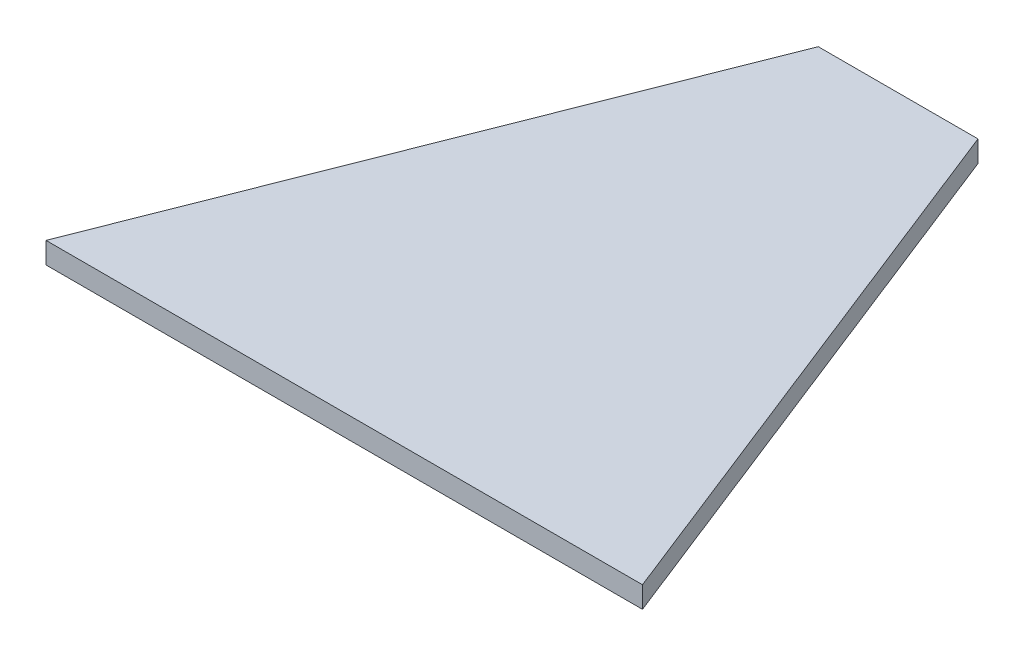
ISO-10303-21;
HEADER;
FILE_DESCRIPTION(('STEP AP214'),'2;1');
FILE_NAME('part.step','',(''),(''),'','','');
FILE_SCHEMA(('AUTOMOTIVE_DESIGN { 1 0 10303 214 1 1 1 1 }'));
ENDSEC;
DATA;
#1=APPLICATION_CONTEXT('core data for automotive mechanical design processes');
#2=APPLICATION_PROTOCOL_DEFINITION('international standard','automotive_design',2000,#1);
#3=PRODUCT_CONTEXT('',#1,'mechanical');
#4=PRODUCT('Part','Part','',(#3));
#5=PRODUCT_RELATED_PRODUCT_CATEGORY('part','',(#4));
#6=PRODUCT_DEFINITION_FORMATION('','',#4);
#7=PRODUCT_DEFINITION_CONTEXT('part definition',#1,'design');
#8=PRODUCT_DEFINITION('design','',#6,#7);
#9=PRODUCT_DEFINITION_SHAPE('','',#8);
#10=(LENGTH_UNIT() NAMED_UNIT(*) SI_UNIT(.MILLI.,.METRE.));
#11=(NAMED_UNIT(*) PLANE_ANGLE_UNIT() SI_UNIT($,.RADIAN.));
#12=(NAMED_UNIT(*) SI_UNIT($,.STERADIAN.) SOLID_ANGLE_UNIT());
#13=UNCERTAINTY_MEASURE_WITH_UNIT(LENGTH_MEASURE(1.E-05),#10,'distance_accuracy_value','');
#14=(GEOMETRIC_REPRESENTATION_CONTEXT(3) GLOBAL_UNCERTAINTY_ASSIGNED_CONTEXT((#13)) GLOBAL_UNIT_ASSIGNED_CONTEXT((#10,
#11,#12)) REPRESENTATION_CONTEXT('',''));
#15=CARTESIAN_POINT('',(0.,0.,0.));
#16=DIRECTION('',(0.,0.,1.));
#17=DIRECTION('',(1.,0.,0.));
#18=AXIS2_PLACEMENT_3D('',#15,#16,#17);
#19=CARTESIAN_POINT('',(-14.9999999999997,3.99999999999999,-104.));
#20=DIRECTION('',(0.930315923249783,0.,0.36675916205039));
#21=DIRECTION('',(0.36675916205039,0.,-0.930315923249782));
#22=AXIS2_PLACEMENT_3D('',#19,#20,#21);
#23=PLANE('',#22);
#24=DIRECTION('',(-0.36675916205039,0.,0.930315923249782));
#25=VECTOR('',#24,1.);
#26=CARTESIAN_POINT('',(-14.9999999999997,0.,-104.));
#27=LINE('',#26,#25);
#28=CARTESIAN_POINT('',(-14.9999999999997,0.,-104.));
#29=VERTEX_POINT('',#28);
#30=CARTESIAN_POINT('',(-55.9999999999995,0.,-4.44089209850063E-13));
#31=VERTEX_POINT('',#30);
#32=EDGE_CURVE('E97',#29,#31,#27,.T.);
#33=ORIENTED_EDGE('',*,*,#32,.T.);
#34=DIRECTION('',(0.,-1.,0.));
#35=VECTOR('',#34,1.);
#36=CARTESIAN_POINT('',(-55.9999999999995,3.99999999999999,-4.44089209850063E-13));
#37=LINE('',#36,#35);
#38=CARTESIAN_POINT('',(-55.9999999999995,3.99999999999999,-4.44089209850063E-13));
#39=VERTEX_POINT('',#38);
#40=EDGE_CURVE('E11',#39,#31,#37,.T.);
#41=ORIENTED_EDGE('',*,*,#40,.F.);
#42=DIRECTION('',(-0.36675916205039,0.,0.930315923249782));
#43=VECTOR('',#42,1.);
#44=CARTESIAN_POINT('',(-14.9999999999997,3.99999999999999,-104.));
#45=LINE('',#44,#43);
#46=CARTESIAN_POINT('',(-14.9999999999997,3.99999999999999,-104.));
#47=VERTEX_POINT('',#46);
#48=EDGE_CURVE('E85',#47,#39,#45,.T.);
#49=ORIENTED_EDGE('',*,*,#48,.F.);
#50=DIRECTION('',(0.,-1.,0.));
#51=VECTOR('',#50,1.);
#52=CARTESIAN_POINT('',(-14.9999999999997,3.99999999999999,-104.));
#53=LINE('',#52,#51);
#54=EDGE_CURVE('E93',#47,#29,#53,.T.);
#55=ORIENTED_EDGE('',*,*,#54,.T.);
#56=EDGE_LOOP('',(#33,#41,#49,#55));
#57=FACE_BOUND('',#56,.T.);
#58=ADVANCED_FACE('F34',(#57),#23,.F.);
#59=CARTESIAN_POINT('',(-55.9999999999995,3.99999999999999,-4.44089209850063E-13));
#60=DIRECTION('',(0.,0.,-0.999999999999999));
#61=DIRECTION('',(-1.,0.,0.));
#62=AXIS2_PLACEMENT_3D('',#59,#60,#61);
#63=PLANE('',#62);
#64=DIRECTION('',(1.,0.,0.));
#65=VECTOR('',#64,1.);
#66=CARTESIAN_POINT('',(-55.9999999999995,0.,-4.44089209850063E-13));
#67=LINE('',#66,#65);
#68=CARTESIAN_POINT('',(55.9999999999987,0.,0.));
#69=VERTEX_POINT('',#68);
#70=EDGE_CURVE('E89',#31,#69,#67,.T.);
#71=ORIENTED_EDGE('',*,*,#70,.T.);
#72=DIRECTION('',(0.,-1.,0.));
#73=VECTOR('',#72,1.);
#74=CARTESIAN_POINT('',(55.9999999999987,3.99999999999999,0.));
#75=LINE('',#74,#73);
#76=CARTESIAN_POINT('',(55.9999999999987,3.99999999999999,0.));
#77=VERTEX_POINT('',#76);
#78=EDGE_CURVE('E42',#77,#69,#75,.T.);
#79=ORIENTED_EDGE('',*,*,#78,.F.);
#80=DIRECTION('',(1.,0.,0.));
#81=VECTOR('',#80,1.);
#82=CARTESIAN_POINT('',(-55.9999999999995,3.99999999999999,-4.44089209850063E-13));
#83=LINE('',#82,#81);
#84=EDGE_CURVE('E80',#39,#77,#83,.T.);
#85=ORIENTED_EDGE('',*,*,#84,.F.);
#86=ORIENTED_EDGE('',*,*,#40,.T.);
#87=EDGE_LOOP('',(#71,#79,#85,#86));
#88=FACE_BOUND('',#87,.T.);
#89=ADVANCED_FACE('F88',(#88),#63,.F.);
#90=CARTESIAN_POINT('',(55.9999999999987,3.99999999999999,0.));
#91=DIRECTION('',(-0.930315923249785,0.,0.366759162050385));
#92=DIRECTION('',(0.366759162050385,0.,0.930315923249784));
#93=AXIS2_PLACEMENT_3D('',#90,#91,#92);
#94=PLANE('',#93);
#95=DIRECTION('',(-0.366759162050385,0.,-0.930315923249784));
#96=VECTOR('',#95,1.);
#97=CARTESIAN_POINT('',(55.9999999999987,0.,0.));
#98=LINE('',#97,#96);
#99=CARTESIAN_POINT('',(15.0000000000003,0.,-104.));
#100=VERTEX_POINT('',#99);
#101=EDGE_CURVE('E67',#69,#100,#98,.T.);
#102=ORIENTED_EDGE('',*,*,#101,.T.);
#103=DIRECTION('',(0.,-1.,0.));
#104=VECTOR('',#103,1.);
#105=CARTESIAN_POINT('',(15.0000000000003,4.00000000000002,-104.));
#106=LINE('',#105,#104);
#107=CARTESIAN_POINT('',(15.0000000000003,4.00000000000002,-104.));
#108=VERTEX_POINT('',#107);
#109=EDGE_CURVE('E90',#108,#100,#106,.T.);
#110=ORIENTED_EDGE('',*,*,#109,.F.);
#111=DIRECTION('',(-0.366759162050385,0.,-0.930315923249784));
#112=VECTOR('',#111,1.);
#113=CARTESIAN_POINT('',(55.9999999999987,3.99999999999999,0.));
#114=LINE('',#113,#112);
#115=EDGE_CURVE('E83',#77,#108,#114,.T.);
#116=ORIENTED_EDGE('',*,*,#115,.F.);
#117=ORIENTED_EDGE('',*,*,#78,.T.);
#118=EDGE_LOOP('',(#102,#110,#116,#117));
#119=FACE_BOUND('',#118,.T.);
#120=ADVANCED_FACE('F91',(#119),#94,.F.);
#121=CARTESIAN_POINT('',(15.0000000000003,4.00000000000002,-104.));
#122=DIRECTION('',(0.,0.,0.999999999999999));
#123=DIRECTION('',(1.,0.,0.));
#124=AXIS2_PLACEMENT_3D('',#121,#122,#123);
#125=PLANE('',#124);
#126=DIRECTION('',(-1.,0.,0.));
#127=VECTOR('',#126,1.);
#128=CARTESIAN_POINT('',(15.0000000000003,0.,-104.));
#129=LINE('',#128,#127);
#130=EDGE_CURVE('E73',#100,#29,#129,.T.);
#131=ORIENTED_EDGE('',*,*,#130,.T.);
#132=ORIENTED_EDGE('',*,*,#54,.F.);
#133=DIRECTION('',(-1.,0.,0.));
#134=VECTOR('',#133,1.);
#135=CARTESIAN_POINT('',(15.0000000000003,4.00000000000002,-104.));
#136=LINE('',#135,#134);
#137=EDGE_CURVE('E50',#108,#47,#136,.T.);
#138=ORIENTED_EDGE('',*,*,#137,.F.);
#139=ORIENTED_EDGE('',*,*,#109,.T.);
#140=EDGE_LOOP('',(#131,#132,#138,#139));
#141=FACE_BOUND('',#140,.T.);
#142=ADVANCED_FACE('F104',(#141),#125,.F.);
#143=CARTESIAN_POINT('',(0.,3.99999999999999,0.));
#144=DIRECTION('',(0.,1.,0.));
#145=DIRECTION('',(0.,0.,0.999999999999999));
#146=AXIS2_PLACEMENT_3D('',#143,#144,#145);
#147=PLANE('',#146);
#148=ORIENTED_EDGE('',*,*,#48,.T.);
#149=ORIENTED_EDGE('',*,*,#84,.T.);
#150=ORIENTED_EDGE('',*,*,#115,.T.);
#151=ORIENTED_EDGE('',*,*,#137,.T.);
#152=EDGE_LOOP('',(#148,#149,#150,#151));
#153=FACE_BOUND('',#152,.T.);
#154=ADVANCED_FACE('F81',(#153),#147,.T.);
#155=CARTESIAN_POINT('',(0.,0.,0.));
#156=DIRECTION('',(0.,1.,0.));
#157=DIRECTION('',(0.,0.,0.999999999999999));
#158=AXIS2_PLACEMENT_3D('',#155,#156,#157);
#159=PLANE('',#158);
#160=ORIENTED_EDGE('',*,*,#32,.F.);
#161=ORIENTED_EDGE('',*,*,#130,.F.);
#162=ORIENTED_EDGE('',*,*,#101,.F.);
#163=ORIENTED_EDGE('',*,*,#70,.F.);
#164=EDGE_LOOP('',(#160,#161,#162,#163));
#165=FACE_BOUND('',#164,.T.);
#166=ADVANCED_FACE('F107',(#165),#159,.F.);
#167=CLOSED_SHELL('',(#58,#89,#120,#142,#154,#166));
#168=MANIFOLD_SOLID_BREP('B2',#167);
#169=ADVANCED_BREP_SHAPE_REPRESENTATION('',(#18,#168),#14);
#170=SHAPE_DEFINITION_REPRESENTATION(#9,#169);
ENDSEC;
END-ISO-10303-21;
